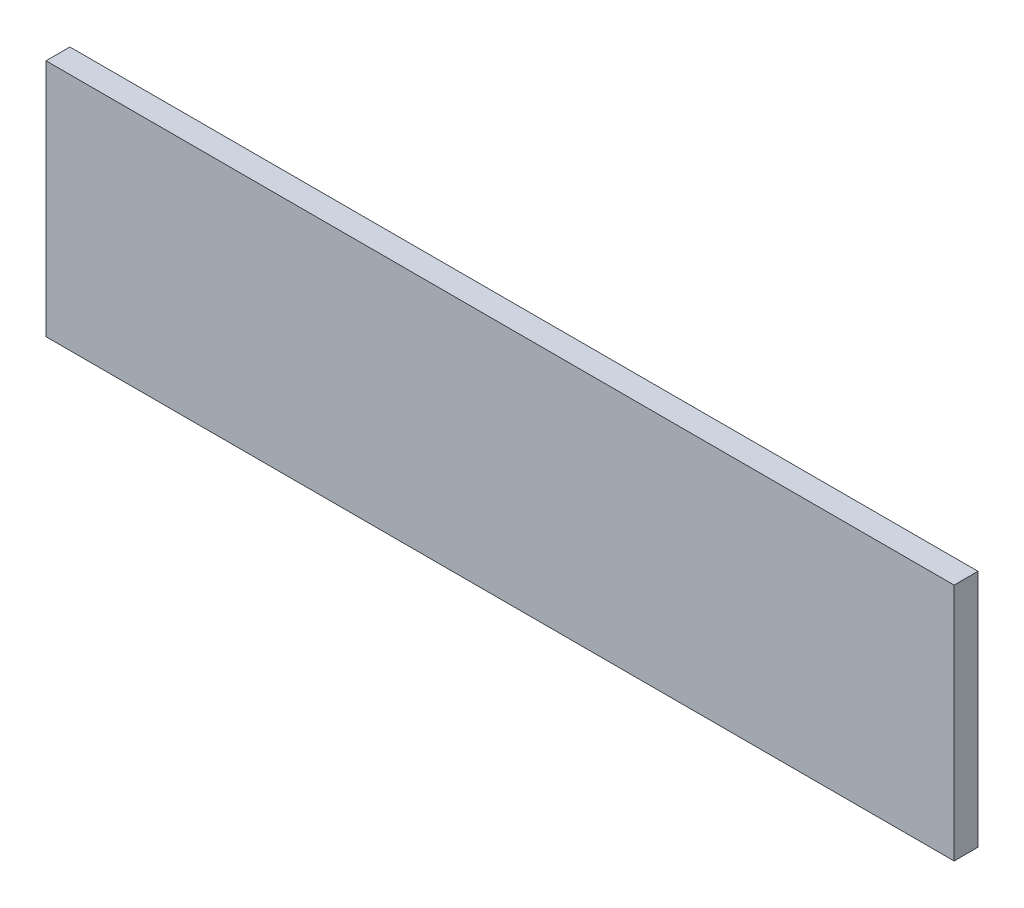
ISO-10303-21;
HEADER;
FILE_DESCRIPTION(('STEP AP214'),'2;1');
FILE_NAME('part.step','',(''),(''),'','','');
FILE_SCHEMA(('AUTOMOTIVE_DESIGN { 1 0 10303 214 1 1 1 1 }'));
ENDSEC;
DATA;
#1=APPLICATION_CONTEXT('core data for automotive mechanical design processes');
#2=APPLICATION_PROTOCOL_DEFINITION('international standard','automotive_design',2000,#1);
#3=PRODUCT_CONTEXT('',#1,'mechanical');
#4=PRODUCT('Part','Part','',(#3));
#5=PRODUCT_RELATED_PRODUCT_CATEGORY('part','',(#4));
#6=PRODUCT_DEFINITION_FORMATION('','',#4);
#7=PRODUCT_DEFINITION_CONTEXT('part definition',#1,'design');
#8=PRODUCT_DEFINITION('design','',#6,#7);
#9=PRODUCT_DEFINITION_SHAPE('','',#8);
#10=(LENGTH_UNIT() NAMED_UNIT(*) SI_UNIT(.MILLI.,.METRE.));
#11=(NAMED_UNIT(*) PLANE_ANGLE_UNIT() SI_UNIT($,.RADIAN.));
#12=(NAMED_UNIT(*) SI_UNIT($,.STERADIAN.) SOLID_ANGLE_UNIT());
#13=UNCERTAINTY_MEASURE_WITH_UNIT(LENGTH_MEASURE(1.E-05),#10,'distance_accuracy_value','');
#14=(GEOMETRIC_REPRESENTATION_CONTEXT(3) GLOBAL_UNCERTAINTY_ASSIGNED_CONTEXT((#13)) GLOBAL_UNIT_ASSIGNED_CONTEXT((#10,
#11,#12)) REPRESENTATION_CONTEXT('',''));
#15=CARTESIAN_POINT('',(0.,0.,0.));
#16=DIRECTION('',(0.,0.,1.));
#17=DIRECTION('',(1.,0.,0.));
#18=AXIS2_PLACEMENT_3D('',#15,#16,#17);
#19=CARTESIAN_POINT('',(241.3,-63.5,12.7));
#20=DIRECTION('',(-1.,0.,0.));
#21=DIRECTION('',(0.,0.,1.));
#22=AXIS2_PLACEMENT_3D('',#19,#20,#21);
#23=PLANE('',#22);
#24=DIRECTION('',(0.,1.,0.));
#25=VECTOR('',#24,1.);
#26=CARTESIAN_POINT('',(241.3,-63.5,0.));
#27=LINE('',#26,#25);
#28=CARTESIAN_POINT('',(241.3,-63.5,0.));
#29=VERTEX_POINT('',#28);
#30=CARTESIAN_POINT('',(241.3,63.5,0.));
#31=VERTEX_POINT('',#30);
#32=EDGE_CURVE('E96',#29,#31,#27,.T.);
#33=ORIENTED_EDGE('',*,*,#32,.T.);
#34=DIRECTION('',(0.,0.,-1.));
#35=VECTOR('',#34,1.);
#36=CARTESIAN_POINT('',(241.3,63.5,12.7));
#37=LINE('',#36,#35);
#38=CARTESIAN_POINT('',(241.3,63.5,12.7));
#39=VERTEX_POINT('',#38);
#40=EDGE_CURVE('E11',#39,#31,#37,.T.);
#41=ORIENTED_EDGE('',*,*,#40,.F.);
#42=DIRECTION('',(0.,1.,0.));
#43=VECTOR('',#42,1.);
#44=CARTESIAN_POINT('',(241.3,-63.5,12.7));
#45=LINE('',#44,#43);
#46=CARTESIAN_POINT('',(241.3,-63.5,12.7));
#47=VERTEX_POINT('',#46);
#48=EDGE_CURVE('E84',#47,#39,#45,.T.);
#49=ORIENTED_EDGE('',*,*,#48,.F.);
#50=DIRECTION('',(0.,0.,-1.));
#51=VECTOR('',#50,1.);
#52=CARTESIAN_POINT('',(241.3,-63.5,12.7));
#53=LINE('',#52,#51);
#54=EDGE_CURVE('E92',#47,#29,#53,.T.);
#55=ORIENTED_EDGE('',*,*,#54,.T.);
#56=EDGE_LOOP('',(#33,#41,#49,#55));
#57=FACE_BOUND('',#56,.T.);
#58=ADVANCED_FACE('F33',(#57),#23,.F.);
#59=CARTESIAN_POINT('',(-241.3,63.5,12.7));
#60=DIRECTION('',(0.,-1.,0.));
#61=DIRECTION('',(0.,0.,-1.));
#62=AXIS2_PLACEMENT_3D('',#59,#60,#61);
#63=PLANE('',#62);
#64=DIRECTION('',(-1.,0.,0.));
#65=VECTOR('',#64,1.);
#66=CARTESIAN_POINT('',(-241.3,63.5,0.));
#67=LINE('',#66,#65);
#68=CARTESIAN_POINT('',(-241.3,63.5,0.));
#69=VERTEX_POINT('',#68);
#70=EDGE_CURVE('E88',#31,#69,#67,.T.);
#71=ORIENTED_EDGE('',*,*,#70,.T.);
#72=DIRECTION('',(0.,0.,-1.));
#73=VECTOR('',#72,1.);
#74=CARTESIAN_POINT('',(-241.3,63.5,12.7));
#75=LINE('',#74,#73);
#76=CARTESIAN_POINT('',(-241.3,63.5,12.7));
#77=VERTEX_POINT('',#76);
#78=EDGE_CURVE('E41',#77,#69,#75,.T.);
#79=ORIENTED_EDGE('',*,*,#78,.F.);
#80=DIRECTION('',(-1.,0.,0.));
#81=VECTOR('',#80,1.);
#82=CARTESIAN_POINT('',(-241.3,63.5,12.7));
#83=LINE('',#82,#81);
#84=EDGE_CURVE('E79',#39,#77,#83,.T.);
#85=ORIENTED_EDGE('',*,*,#84,.F.);
#86=ORIENTED_EDGE('',*,*,#40,.T.);
#87=EDGE_LOOP('',(#71,#79,#85,#86));
#88=FACE_BOUND('',#87,.T.);
#89=ADVANCED_FACE('F87',(#88),#63,.F.);
#90=CARTESIAN_POINT('',(-241.3,-63.5,12.7));
#91=DIRECTION('',(1.,0.,0.));
#92=DIRECTION('',(0.,0.,-1.));
#93=AXIS2_PLACEMENT_3D('',#90,#91,#92);
#94=PLANE('',#93);
#95=DIRECTION('',(0.,-1.,0.));
#96=VECTOR('',#95,1.);
#97=CARTESIAN_POINT('',(-241.3,-63.5,0.));
#98=LINE('',#97,#96);
#99=CARTESIAN_POINT('',(-241.3,-63.5,0.));
#100=VERTEX_POINT('',#99);
#101=EDGE_CURVE('E66',#69,#100,#98,.T.);
#102=ORIENTED_EDGE('',*,*,#101,.T.);
#103=DIRECTION('',(0.,0.,-1.));
#104=VECTOR('',#103,1.);
#105=CARTESIAN_POINT('',(-241.3,-63.5,12.7));
#106=LINE('',#105,#104);
#107=CARTESIAN_POINT('',(-241.3,-63.5,12.7));
#108=VERTEX_POINT('',#107);
#109=EDGE_CURVE('E89',#108,#100,#106,.T.);
#110=ORIENTED_EDGE('',*,*,#109,.F.);
#111=DIRECTION('',(0.,-1.,0.));
#112=VECTOR('',#111,1.);
#113=CARTESIAN_POINT('',(-241.3,-63.5,12.7));
#114=LINE('',#113,#112);
#115=EDGE_CURVE('E82',#77,#108,#114,.T.);
#116=ORIENTED_EDGE('',*,*,#115,.F.);
#117=ORIENTED_EDGE('',*,*,#78,.T.);
#118=EDGE_LOOP('',(#102,#110,#116,#117));
#119=FACE_BOUND('',#118,.T.);
#120=ADVANCED_FACE('F90',(#119),#94,.F.);
#121=CARTESIAN_POINT('',(-241.3,-63.5,12.7));
#122=DIRECTION('',(0.,1.,0.));
#123=DIRECTION('',(0.,0.,1.));
#124=AXIS2_PLACEMENT_3D('',#121,#122,#123);
#125=PLANE('',#124);
#126=DIRECTION('',(1.,0.,0.));
#127=VECTOR('',#126,1.);
#128=CARTESIAN_POINT('',(-241.3,-63.5,0.));
#129=LINE('',#128,#127);
#130=EDGE_CURVE('E72',#100,#29,#129,.T.);
#131=ORIENTED_EDGE('',*,*,#130,.T.);
#132=ORIENTED_EDGE('',*,*,#54,.F.);
#133=DIRECTION('',(1.,0.,0.));
#134=VECTOR('',#133,1.);
#135=CARTESIAN_POINT('',(-241.3,-63.5,12.7));
#136=LINE('',#135,#134);
#137=EDGE_CURVE('E49',#108,#47,#136,.T.);
#138=ORIENTED_EDGE('',*,*,#137,.F.);
#139=ORIENTED_EDGE('',*,*,#109,.T.);
#140=EDGE_LOOP('',(#131,#132,#138,#139));
#141=FACE_BOUND('',#140,.T.);
#142=ADVANCED_FACE('F103',(#141),#125,.F.);
#143=CARTESIAN_POINT('',(0.,0.,12.7));
#144=DIRECTION('',(0.,0.,-1.));
#145=DIRECTION('',(-1.,0.,0.));
#146=AXIS2_PLACEMENT_3D('',#143,#144,#145);
#147=PLANE('',#146);
#148=ORIENTED_EDGE('',*,*,#48,.T.);
#149=ORIENTED_EDGE('',*,*,#84,.T.);
#150=ORIENTED_EDGE('',*,*,#115,.T.);
#151=ORIENTED_EDGE('',*,*,#137,.T.);
#152=EDGE_LOOP('',(#148,#149,#150,#151));
#153=FACE_BOUND('',#152,.T.);
#154=ADVANCED_FACE('F80',(#153),#147,.F.);
#155=CARTESIAN_POINT('',(0.,0.,0.));
#156=DIRECTION('',(0.,0.,-1.));
#157=DIRECTION('',(-1.,0.,0.));
#158=AXIS2_PLACEMENT_3D('',#155,#156,#157);
#159=PLANE('',#158);
#160=ORIENTED_EDGE('',*,*,#32,.F.);
#161=ORIENTED_EDGE('',*,*,#130,.F.);
#162=ORIENTED_EDGE('',*,*,#101,.F.);
#163=ORIENTED_EDGE('',*,*,#70,.F.);
#164=EDGE_LOOP('',(#160,#161,#162,#163));
#165=FACE_BOUND('',#164,.T.);
#166=ADVANCED_FACE('F106',(#165),#159,.T.);
#167=CLOSED_SHELL('',(#58,#89,#120,#142,#154,#166));
#168=MANIFOLD_SOLID_BREP('B2',#167);
#169=ADVANCED_BREP_SHAPE_REPRESENTATION('',(#18,#168),#14);
#170=SHAPE_DEFINITION_REPRESENTATION(#9,#169);
ENDSEC;
END-ISO-10303-21;
